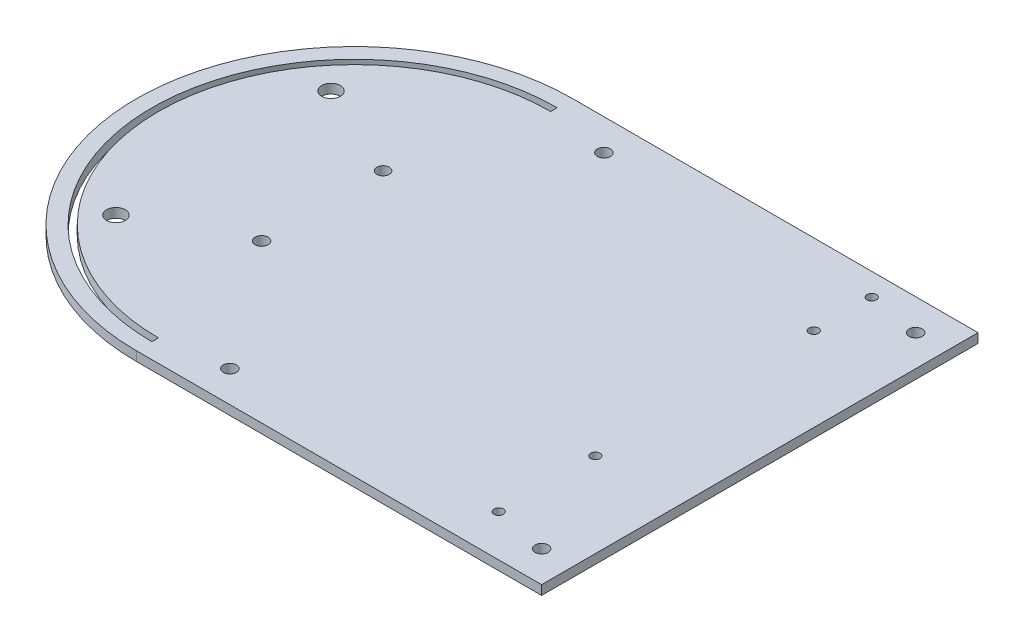
ISO-10303-21;
HEADER;
FILE_DESCRIPTION(('STEP AP214'),'2;1');
FILE_NAME('part.step','',(''),(''),'','','');
FILE_SCHEMA(('AUTOMOTIVE_DESIGN { 1 0 10303 214 1 1 1 1 }'));
ENDSEC;
DATA;
#1=APPLICATION_CONTEXT('core data for automotive mechanical design processes');
#2=APPLICATION_PROTOCOL_DEFINITION('international standard','automotive_design',2000,#1);
#3=PRODUCT_CONTEXT('',#1,'mechanical');
#4=PRODUCT('Part','Part','',(#3));
#5=PRODUCT_RELATED_PRODUCT_CATEGORY('part','',(#4));
#6=PRODUCT_DEFINITION_FORMATION('','',#4);
#7=PRODUCT_DEFINITION_CONTEXT('part definition',#1,'design');
#8=PRODUCT_DEFINITION('design','',#6,#7);
#9=PRODUCT_DEFINITION_SHAPE('','',#8);
#10=(LENGTH_UNIT() NAMED_UNIT(*) SI_UNIT(.MILLI.,.METRE.));
#11=(NAMED_UNIT(*) PLANE_ANGLE_UNIT() SI_UNIT($,.RADIAN.));
#12=(NAMED_UNIT(*) SI_UNIT($,.STERADIAN.) SOLID_ANGLE_UNIT());
#13=UNCERTAINTY_MEASURE_WITH_UNIT(LENGTH_MEASURE(1.E-05),#10,'distance_accuracy_value','');
#14=(GEOMETRIC_REPRESENTATION_CONTEXT(3) GLOBAL_UNCERTAINTY_ASSIGNED_CONTEXT((#13)) GLOBAL_UNIT_ASSIGNED_CONTEXT((#10,
#11,#12)) REPRESENTATION_CONTEXT('',''));
#15=CARTESIAN_POINT('',(0.,0.,0.));
#16=DIRECTION('',(0.,0.,1.));
#17=DIRECTION('',(1.,0.,0.));
#18=AXIS2_PLACEMENT_3D('',#15,#16,#17);
#19=CARTESIAN_POINT('',(-65.,3.,0.));
#20=DIRECTION('',(0.,-1.,0.));
#21=DIRECTION('',(0.,0.,-1.));
#22=AXIS2_PLACEMENT_3D('',#19,#20,#21);
#23=PLANE('',#22);
#24=CARTESIAN_POINT('',(-65.,3.,0.));
#25=DIRECTION('',(0.,1.,0.));
#26=DIRECTION('',(0.,0.,-1.));
#27=AXIS2_PLACEMENT_3D('',#24,#25,#26);
#28=CIRCLE('',#27,70.);
#29=CARTESIAN_POINT('',(-65.,3.,-70.));
#30=VERTEX_POINT('',#29);
#31=CARTESIAN_POINT('',(-65.,3.,70.));
#32=VERTEX_POINT('',#31);
#33=EDGE_CURVE('E141',#30,#32,#28,.T.);
#34=ORIENTED_EDGE('',*,*,#33,.T.);
#35=DIRECTION('',(1.,0.,0.));
#36=VECTOR('',#35,1.);
#37=CARTESIAN_POINT('',(65.,3.,70.));
#38=LINE('',#37,#36);
#39=CARTESIAN_POINT('',(65.,3.,70.));
#40=VERTEX_POINT('',#39);
#41=EDGE_CURVE('E144',#32,#40,#38,.T.);
#42=ORIENTED_EDGE('',*,*,#41,.T.);
#43=DIRECTION('',(0.,0.,-1.));
#44=VECTOR('',#43,1.);
#45=CARTESIAN_POINT('',(65.,3.,70.));
#46=LINE('',#45,#44);
#47=CARTESIAN_POINT('',(65.,3.,-70.));
#48=VERTEX_POINT('',#47);
#49=EDGE_CURVE('E147',#40,#48,#46,.T.);
#50=ORIENTED_EDGE('',*,*,#49,.T.);
#51=DIRECTION('',(-1.,0.,0.));
#52=VECTOR('',#51,1.);
#53=CARTESIAN_POINT('',(65.,3.,-70.));
#54=LINE('',#53,#52);
#55=EDGE_CURVE('E149',#48,#30,#54,.T.);
#56=ORIENTED_EDGE('',*,*,#55,.T.);
#57=EDGE_LOOP('',(#34,#42,#50,#56));
#58=FACE_BOUND('',#57,.T.);
#59=CARTESIAN_POINT('',(-65.,3.,0.));
#60=DIRECTION('',(0.,1.,0.));
#61=DIRECTION('',(0.,0.,-1.));
#62=AXIS2_PLACEMENT_3D('',#59,#60,#61);
#63=CIRCLE('',#62,65.);
#64=CARTESIAN_POINT('',(-65.,3.,-65.));
#65=VERTEX_POINT('',#64);
#66=CARTESIAN_POINT('',(-65.,3.,65.));
#67=VERTEX_POINT('',#66);
#68=EDGE_CURVE('E102',#65,#67,#63,.T.);
#69=ORIENTED_EDGE('',*,*,#68,.F.);
#70=DIRECTION('',(0.,0.,-1.));
#71=VECTOR('',#70,1.);
#72=CARTESIAN_POINT('',(-65.,3.,-65.));
#73=LINE('',#72,#71);
#74=CARTESIAN_POINT('',(-65.,3.,-62.9));
#75=VERTEX_POINT('',#74);
#76=EDGE_CURVE('E125',#75,#65,#73,.T.);
#77=ORIENTED_EDGE('',*,*,#76,.F.);
#78=CARTESIAN_POINT('',(-65.0000000000001,3.,0.));
#79=DIRECTION('',(0.,-1.,0.));
#80=DIRECTION('',(0.,0.,-1.));
#81=AXIS2_PLACEMENT_3D('',#78,#79,#80);
#82=CIRCLE('',#81,62.9);
#83=CARTESIAN_POINT('',(-65.,3.,62.9));
#84=VERTEX_POINT('',#83);
#85=EDGE_CURVE('E123',#84,#75,#82,.T.);
#86=ORIENTED_EDGE('',*,*,#85,.F.);
#87=DIRECTION('',(0.,0.,-1.));
#88=VECTOR('',#87,1.);
#89=CARTESIAN_POINT('',(-65.,3.,62.9));
#90=LINE('',#89,#88);
#91=EDGE_CURVE('E110',#67,#84,#90,.T.);
#92=ORIENTED_EDGE('',*,*,#91,.F.);
#93=EDGE_LOOP('',(#69,#77,#86,#92));
#94=FACE_BOUND('',#93,.T.);
#95=CARTESIAN_POINT('',(-45.,3.,60.));
#96=DIRECTION('',(0.,1.,0.));
#97=DIRECTION('',(0.,0.,1.));
#98=AXIS2_PLACEMENT_3D('',#95,#96,#97);
#99=CIRCLE('',#98,2.1);
#100=CARTESIAN_POINT('',(-45.,3.,62.1));
#101=VERTEX_POINT('',#100);
#102=EDGE_CURVE('E131',#101,#101,#99,.T.);
#103=ORIENTED_EDGE('',*,*,#102,.F.);
#104=EDGE_LOOP('',(#103));
#105=FACE_BOUND('',#104,.T.);
#106=CARTESIAN_POINT('',(-45.,3.,-60.));
#107=DIRECTION('',(0.,1.,0.));
#108=DIRECTION('',(0.,0.,1.));
#109=AXIS2_PLACEMENT_3D('',#106,#107,#108);
#110=CIRCLE('',#109,2.1);
#111=CARTESIAN_POINT('',(-45.,3.,-57.9));
#112=VERTEX_POINT('',#111);
#113=EDGE_CURVE('E333',#112,#112,#110,.T.);
#114=ORIENTED_EDGE('',*,*,#113,.F.);
#115=EDGE_LOOP('',(#114));
#116=FACE_BOUND('',#115,.T.);
#117=CARTESIAN_POINT('',(55.,3.,60.));
#118=DIRECTION('',(0.,1.,0.));
#119=DIRECTION('',(0.,0.,1.));
#120=AXIS2_PLACEMENT_3D('',#117,#118,#119);
#121=CIRCLE('',#120,2.1);
#122=CARTESIAN_POINT('',(55.,3.,62.1));
#123=VERTEX_POINT('',#122);
#124=EDGE_CURVE('E327',#123,#123,#121,.T.);
#125=ORIENTED_EDGE('',*,*,#124,.F.);
#126=EDGE_LOOP('',(#125));
#127=FACE_BOUND('',#126,.T.);
#128=CARTESIAN_POINT('',(55.,3.,-60.));
#129=DIRECTION('',(0.,1.,0.));
#130=DIRECTION('',(0.,0.,1.));
#131=AXIS2_PLACEMENT_3D('',#128,#129,#130);
#132=CIRCLE('',#131,2.1);
#133=CARTESIAN_POINT('',(55.,3.,-57.9));
#134=VERTEX_POINT('',#133);
#135=EDGE_CURVE('E321',#134,#134,#132,.T.);
#136=ORIENTED_EDGE('',*,*,#135,.F.);
#137=EDGE_LOOP('',(#136));
#138=FACE_BOUND('',#137,.T.);
#139=CARTESIAN_POINT('',(38.0992714590828,3.,-62.7999999999986));
#140=DIRECTION('',(0.,1.,0.));
#141=DIRECTION('',(0.,0.,1.));
#142=AXIS2_PLACEMENT_3D('',#139,#140,#141);
#143=CIRCLE('',#142,1.5);
#144=CARTESIAN_POINT('',(38.0992714590828,3.,-61.2999999999986));
#145=VERTEX_POINT('',#144);
#146=EDGE_CURVE('E315',#145,#145,#143,.T.);
#147=ORIENTED_EDGE('',*,*,#146,.F.);
#148=EDGE_LOOP('',(#147));
#149=FACE_BOUND('',#148,.T.);
#150=CARTESIAN_POINT('',(38.0992714590826,3.,-44.1999999999986));
#151=DIRECTION('',(0.,1.,0.));
#152=DIRECTION('',(0.,0.,1.));
#153=AXIS2_PLACEMENT_3D('',#150,#151,#152);
#154=CIRCLE('',#153,1.50000000000001);
#155=CARTESIAN_POINT('',(38.0992714590826,3.,-42.6999999999986));
#156=VERTEX_POINT('',#155);
#157=EDGE_CURVE('E309',#156,#156,#154,.T.);
#158=ORIENTED_EDGE('',*,*,#157,.F.);
#159=EDGE_LOOP('',(#158));
#160=FACE_BOUND('',#159,.T.);
#161=CARTESIAN_POINT('',(37.8419640009305,3.,25.6));
#162=DIRECTION('',(0.,1.,0.));
#163=DIRECTION('',(0.,0.,1.));
#164=AXIS2_PLACEMENT_3D('',#161,#162,#163);
#165=CIRCLE('',#164,1.50000000000054);
#166=CARTESIAN_POINT('',(37.8419640009305,3.,27.1000000000005));
#167=VERTEX_POINT('',#166);
#168=EDGE_CURVE('E303',#167,#167,#165,.T.);
#169=ORIENTED_EDGE('',*,*,#168,.F.);
#170=EDGE_LOOP('',(#169));
#171=FACE_BOUND('',#170,.T.);
#172=CARTESIAN_POINT('',(37.8419640009305,3.,56.6));
#173=DIRECTION('',(0.,1.,0.));
#174=DIRECTION('',(0.,0.,1.));
#175=AXIS2_PLACEMENT_3D('',#172,#173,#174);
#176=CIRCLE('',#175,1.50000000000052);
#177=CARTESIAN_POINT('',(37.8419640009305,3.,58.1000000000005));
#178=VERTEX_POINT('',#177);
#179=EDGE_CURVE('E297',#178,#178,#176,.T.);
#180=ORIENTED_EDGE('',*,*,#179,.F.);
#181=EDGE_LOOP('',(#180));
#182=FACE_BOUND('',#181,.T.);
#183=CARTESIAN_POINT('',(-75.400632029285,3.,19.4261499673664));
#184=DIRECTION('',(0.,1.,0.));
#185=DIRECTION('',(0.,0.,1.));
#186=AXIS2_PLACEMENT_3D('',#183,#184,#185);
#187=CIRCLE('',#186,2.1);
#188=CARTESIAN_POINT('',(-75.400632029285,3.,21.5261499673664));
#189=VERTEX_POINT('',#188);
#190=EDGE_CURVE('E291',#189,#189,#187,.T.);
#191=ORIENTED_EDGE('',*,*,#190,.F.);
#192=EDGE_LOOP('',(#191));
#193=FACE_BOUND('',#192,.T.);
#194=CARTESIAN_POINT('',(-75.3996848108392,3.,-19.5526262936676));
#195=DIRECTION('',(0.,1.,0.));
#196=DIRECTION('',(0.,0.,1.));
#197=AXIS2_PLACEMENT_3D('',#194,#195,#196);
#198=CIRCLE('',#197,2.);
#199=CARTESIAN_POINT('',(-75.3996848108392,3.,-17.5526262936676));
#200=VERTEX_POINT('',#199);
#201=EDGE_CURVE('E285',#200,#200,#198,.T.);
#202=ORIENTED_EDGE('',*,*,#201,.F.);
#203=EDGE_LOOP('',(#202));
#204=FACE_BOUND('',#203,.T.);
#205=CARTESIAN_POINT('',(-105.935731264622,3.,-33.3886238577769));
#206=DIRECTION('',(0.,1.,0.));
#207=DIRECTION('',(0.,0.,1.));
#208=AXIS2_PLACEMENT_3D('',#205,#206,#207);
#209=CIRCLE('',#208,2.99999999979191);
#210=CARTESIAN_POINT('',(-105.935731264622,3.,-30.388623857985));
#211=VERTEX_POINT('',#210);
#212=EDGE_CURVE('E279',#211,#211,#209,.T.);
#213=ORIENTED_EDGE('',*,*,#212,.F.);
#214=EDGE_LOOP('',(#213));
#215=FACE_BOUND('',#214,.T.);
#216=CARTESIAN_POINT('',(-105.935731264623,3.,35.6113761422231));
#217=DIRECTION('',(0.,1.,0.));
#218=DIRECTION('',(0.,0.,1.));
#219=AXIS2_PLACEMENT_3D('',#216,#217,#218);
#220=CIRCLE('',#219,2.99999999958095);
#221=CARTESIAN_POINT('',(-105.935731264623,3.,38.611376141804));
#222=VERTEX_POINT('',#221);
#223=EDGE_CURVE('E270',#222,#222,#220,.T.);
#224=ORIENTED_EDGE('',*,*,#223,.F.);
#225=EDGE_LOOP('',(#224));
#226=FACE_BOUND('',#225,.T.);
#227=ADVANCED_FACE('F37',(#58,#94,#105,#116,#127,#138,#149,#160,#171,#182,#193,#204,#215,#226),
#23,.F.);
#228=CARTESIAN_POINT('',(-65.,0.,0.));
#229=DIRECTION('',(0.,-1.,0.));
#230=DIRECTION('',(0.,0.,-1.));
#231=AXIS2_PLACEMENT_3D('',#228,#229,#230);
#232=PLANE('',#231);
#233=CARTESIAN_POINT('',(-105.935731264622,0.,-33.3886238577769));
#234=DIRECTION('',(0.,1.,0.));
#235=DIRECTION('',(0.,0.,1.));
#236=AXIS2_PLACEMENT_3D('',#233,#234,#235);
#237=CIRCLE('',#236,2.99999999979191);
#238=CARTESIAN_POINT('',(-105.935731264622,0.,-30.388623857985));
#239=VERTEX_POINT('',#238);
#240=EDGE_CURVE('E276',#239,#239,#237,.T.);
#241=ORIENTED_EDGE('',*,*,#240,.T.);
#242=EDGE_LOOP('',(#241));
#243=FACE_BOUND('',#242,.T.);
#244=CARTESIAN_POINT('',(-75.400632029285,0.,19.4261499673664));
#245=DIRECTION('',(0.,1.,0.));
#246=DIRECTION('',(0.,0.,1.));
#247=AXIS2_PLACEMENT_3D('',#244,#245,#246);
#248=CIRCLE('',#247,2.1);
#249=CARTESIAN_POINT('',(-75.400632029285,0.,21.5261499673664));
#250=VERTEX_POINT('',#249);
#251=EDGE_CURVE('E288',#250,#250,#248,.T.);
#252=ORIENTED_EDGE('',*,*,#251,.T.);
#253=EDGE_LOOP('',(#252));
#254=FACE_BOUND('',#253,.T.);
#255=CARTESIAN_POINT('',(37.8419640009305,0.,25.6));
#256=DIRECTION('',(0.,1.,0.));
#257=DIRECTION('',(0.,0.,1.));
#258=AXIS2_PLACEMENT_3D('',#255,#256,#257);
#259=CIRCLE('',#258,1.50000000000054);
#260=CARTESIAN_POINT('',(37.8419640009305,0.,27.1000000000005));
#261=VERTEX_POINT('',#260);
#262=EDGE_CURVE('E300',#261,#261,#259,.T.);
#263=ORIENTED_EDGE('',*,*,#262,.T.);
#264=EDGE_LOOP('',(#263));
#265=FACE_BOUND('',#264,.T.);
#266=CARTESIAN_POINT('',(38.0992714590828,0.,-62.7999999999986));
#267=DIRECTION('',(0.,1.,0.));
#268=DIRECTION('',(0.,0.,1.));
#269=AXIS2_PLACEMENT_3D('',#266,#267,#268);
#270=CIRCLE('',#269,1.5);
#271=CARTESIAN_POINT('',(38.0992714590828,0.,-61.2999999999986));
#272=VERTEX_POINT('',#271);
#273=EDGE_CURVE('E312',#272,#272,#270,.T.);
#274=ORIENTED_EDGE('',*,*,#273,.T.);
#275=EDGE_LOOP('',(#274));
#276=FACE_BOUND('',#275,.T.);
#277=CARTESIAN_POINT('',(55.,0.,60.));
#278=DIRECTION('',(0.,1.,0.));
#279=DIRECTION('',(0.,0.,1.));
#280=AXIS2_PLACEMENT_3D('',#277,#278,#279);
#281=CIRCLE('',#280,2.1);
#282=CARTESIAN_POINT('',(55.,0.,62.1));
#283=VERTEX_POINT('',#282);
#284=EDGE_CURVE('E324',#283,#283,#281,.T.);
#285=ORIENTED_EDGE('',*,*,#284,.T.);
#286=EDGE_LOOP('',(#285));
#287=FACE_BOUND('',#286,.T.);
#288=CARTESIAN_POINT('',(-45.,0.,60.));
#289=DIRECTION('',(0.,1.,0.));
#290=DIRECTION('',(0.,0.,1.));
#291=AXIS2_PLACEMENT_3D('',#288,#289,#290);
#292=CIRCLE('',#291,2.1);
#293=CARTESIAN_POINT('',(-45.,0.,62.1));
#294=VERTEX_POINT('',#293);
#295=EDGE_CURVE('E336',#294,#294,#292,.T.);
#296=ORIENTED_EDGE('',*,*,#295,.T.);
#297=EDGE_LOOP('',(#296));
#298=FACE_BOUND('',#297,.T.);
#299=CARTESIAN_POINT('',(-65.,0.,0.));
#300=DIRECTION('',(0.,1.,0.));
#301=DIRECTION('',(0.,0.,-1.));
#302=AXIS2_PLACEMENT_3D('',#299,#300,#301);
#303=CIRCLE('',#302,70.);
#304=CARTESIAN_POINT('',(-65.,0.,-70.));
#305=VERTEX_POINT('',#304);
#306=CARTESIAN_POINT('',(-65.,0.,70.));
#307=VERTEX_POINT('',#306);
#308=EDGE_CURVE('E118',#305,#307,#303,.T.);
#309=ORIENTED_EDGE('',*,*,#308,.F.);
#310=DIRECTION('',(-1.,0.,0.));
#311=VECTOR('',#310,1.);
#312=CARTESIAN_POINT('',(65.,0.,-70.));
#313=LINE('',#312,#311);
#314=CARTESIAN_POINT('',(65.,0.,-70.));
#315=VERTEX_POINT('',#314);
#316=EDGE_CURVE('E145',#315,#305,#313,.T.);
#317=ORIENTED_EDGE('',*,*,#316,.F.);
#318=DIRECTION('',(0.,0.,-1.));
#319=VECTOR('',#318,1.);
#320=CARTESIAN_POINT('',(65.,0.,70.));
#321=LINE('',#320,#319);
#322=CARTESIAN_POINT('',(65.,0.,70.));
#323=VERTEX_POINT('',#322);
#324=EDGE_CURVE('E156',#323,#315,#321,.T.);
#325=ORIENTED_EDGE('',*,*,#324,.F.);
#326=DIRECTION('',(1.,0.,0.));
#327=VECTOR('',#326,1.);
#328=CARTESIAN_POINT('',(65.,0.,70.));
#329=LINE('',#328,#327);
#330=EDGE_CURVE('E154',#307,#323,#329,.T.);
#331=ORIENTED_EDGE('',*,*,#330,.F.);
#332=EDGE_LOOP('',(#309,#317,#325,#331));
#333=FACE_BOUND('',#332,.T.);
#334=DIRECTION('',(0.,0.,-1.));
#335=VECTOR('',#334,1.);
#336=CARTESIAN_POINT('',(-65.,0.,-65.));
#337=LINE('',#336,#335);
#338=CARTESIAN_POINT('',(-65.0000000000001,0.,-62.9));
#339=VERTEX_POINT('',#338);
#340=CARTESIAN_POINT('',(-65.,0.,-65.));
#341=VERTEX_POINT('',#340);
#342=EDGE_CURVE('E111',#339,#341,#337,.T.);
#343=ORIENTED_EDGE('',*,*,#342,.T.);
#344=CARTESIAN_POINT('',(-65.,0.,0.));
#345=DIRECTION('',(0.,1.,0.));
#346=DIRECTION('',(0.,0.,-1.));
#347=AXIS2_PLACEMENT_3D('',#344,#345,#346);
#348=CIRCLE('',#347,65.);
#349=CARTESIAN_POINT('',(-65.,0.,65.));
#350=VERTEX_POINT('',#349);
#351=EDGE_CURVE('E60',#341,#350,#348,.T.);
#352=ORIENTED_EDGE('',*,*,#351,.T.);
#353=DIRECTION('',(0.,0.,-1.));
#354=VECTOR('',#353,1.);
#355=CARTESIAN_POINT('',(-65.,0.,62.9));
#356=LINE('',#355,#354);
#357=CARTESIAN_POINT('',(-65.,0.,62.9));
#358=VERTEX_POINT('',#357);
#359=EDGE_CURVE('E117',#350,#358,#356,.T.);
#360=ORIENTED_EDGE('',*,*,#359,.T.);
#361=CARTESIAN_POINT('',(-65.0000000000001,0.,0.));
#362=DIRECTION('',(0.,-1.,0.));
#363=DIRECTION('',(0.,0.,-1.));
#364=AXIS2_PLACEMENT_3D('',#361,#362,#363);
#365=CIRCLE('',#364,62.9);
#366=EDGE_CURVE('E133',#358,#339,#365,.T.);
#367=ORIENTED_EDGE('',*,*,#366,.T.);
#368=EDGE_LOOP('',(#343,#352,#360,#367));
#369=FACE_BOUND('',#368,.T.);
#370=CARTESIAN_POINT('',(-45.,0.,-60.));
#371=DIRECTION('',(0.,1.,0.));
#372=DIRECTION('',(0.,0.,1.));
#373=AXIS2_PLACEMENT_3D('',#370,#371,#372);
#374=CIRCLE('',#373,2.1);
#375=CARTESIAN_POINT('',(-45.,0.,-57.9));
#376=VERTEX_POINT('',#375);
#377=EDGE_CURVE('E330',#376,#376,#374,.T.);
#378=ORIENTED_EDGE('',*,*,#377,.T.);
#379=EDGE_LOOP('',(#378));
#380=FACE_BOUND('',#379,.T.);
#381=CARTESIAN_POINT('',(55.,0.,-60.));
#382=DIRECTION('',(0.,1.,0.));
#383=DIRECTION('',(0.,0.,1.));
#384=AXIS2_PLACEMENT_3D('',#381,#382,#383);
#385=CIRCLE('',#384,2.1);
#386=CARTESIAN_POINT('',(55.,0.,-57.9));
#387=VERTEX_POINT('',#386);
#388=EDGE_CURVE('E318',#387,#387,#385,.T.);
#389=ORIENTED_EDGE('',*,*,#388,.T.);
#390=EDGE_LOOP('',(#389));
#391=FACE_BOUND('',#390,.T.);
#392=CARTESIAN_POINT('',(38.0992714590826,0.,-44.1999999999986));
#393=DIRECTION('',(0.,1.,0.));
#394=DIRECTION('',(0.,0.,1.));
#395=AXIS2_PLACEMENT_3D('',#392,#393,#394);
#396=CIRCLE('',#395,1.50000000000001);
#397=CARTESIAN_POINT('',(38.0992714590826,0.,-42.6999999999986));
#398=VERTEX_POINT('',#397);
#399=EDGE_CURVE('E306',#398,#398,#396,.T.);
#400=ORIENTED_EDGE('',*,*,#399,.T.);
#401=EDGE_LOOP('',(#400));
#402=FACE_BOUND('',#401,.T.);
#403=CARTESIAN_POINT('',(37.8419640009305,0.,56.6));
#404=DIRECTION('',(0.,1.,0.));
#405=DIRECTION('',(0.,0.,1.));
#406=AXIS2_PLACEMENT_3D('',#403,#404,#405);
#407=CIRCLE('',#406,1.50000000000052);
#408=CARTESIAN_POINT('',(37.8419640009305,0.,58.1000000000005));
#409=VERTEX_POINT('',#408);
#410=EDGE_CURVE('E294',#409,#409,#407,.T.);
#411=ORIENTED_EDGE('',*,*,#410,.T.);
#412=EDGE_LOOP('',(#411));
#413=FACE_BOUND('',#412,.T.);
#414=CARTESIAN_POINT('',(-75.3996848108392,0.,-19.5526262936676));
#415=DIRECTION('',(0.,1.,0.));
#416=DIRECTION('',(0.,0.,1.));
#417=AXIS2_PLACEMENT_3D('',#414,#415,#416);
#418=CIRCLE('',#417,2.);
#419=CARTESIAN_POINT('',(-75.3996848108392,0.,-17.5526262936676));
#420=VERTEX_POINT('',#419);
#421=EDGE_CURVE('E282',#420,#420,#418,.T.);
#422=ORIENTED_EDGE('',*,*,#421,.T.);
#423=EDGE_LOOP('',(#422));
#424=FACE_BOUND('',#423,.T.);
#425=CARTESIAN_POINT('',(-105.935731264623,0.,35.6113761422231));
#426=DIRECTION('',(0.,1.,0.));
#427=DIRECTION('',(0.,0.,1.));
#428=AXIS2_PLACEMENT_3D('',#425,#426,#427);
#429=CIRCLE('',#428,2.99999999958095);
#430=CARTESIAN_POINT('',(-105.935731264623,0.,38.611376141804));
#431=VERTEX_POINT('',#430);
#432=EDGE_CURVE('E273',#431,#431,#429,.T.);
#433=ORIENTED_EDGE('',*,*,#432,.T.);
#434=EDGE_LOOP('',(#433));
#435=FACE_BOUND('',#434,.T.);
#436=ADVANCED_FACE('F174',(#243,#254,#265,#276,#287,#298,#333,#369,#380,#391,#402,#413,#424,
#435),#232,.T.);
#437=CARTESIAN_POINT('',(-65.,3.,0.));
#438=DIRECTION('',(0.,-1.,0.));
#439=DIRECTION('',(0.,0.,-1.));
#440=AXIS2_PLACEMENT_3D('',#437,#438,#439);
#441=CYLINDRICAL_SURFACE('',#440,70.);
#442=ORIENTED_EDGE('',*,*,#308,.T.);
#443=DIRECTION('',(0.,-1.,0.));
#444=VECTOR('',#443,1.);
#445=CARTESIAN_POINT('',(-65.,3.,70.));
#446=LINE('',#445,#444);
#447=EDGE_CURVE('E11',#32,#307,#446,.T.);
#448=ORIENTED_EDGE('',*,*,#447,.F.);
#449=ORIENTED_EDGE('',*,*,#33,.F.);
#450=DIRECTION('',(0.,-1.,0.));
#451=VECTOR('',#450,1.);
#452=CARTESIAN_POINT('',(-65.,3.,-70.));
#453=LINE('',#452,#451);
#454=EDGE_CURVE('E151',#30,#305,#453,.T.);
#455=ORIENTED_EDGE('',*,*,#454,.T.);
#456=EDGE_LOOP('',(#442,#448,#449,#455));
#457=FACE_BOUND('',#456,.T.);
#458=ADVANCED_FACE('F39',(#457),#441,.T.);
#459=CARTESIAN_POINT('',(65.,3.,70.));
#460=DIRECTION('',(0.,0.,-1.));
#461=DIRECTION('',(-1.,0.,0.));
#462=AXIS2_PLACEMENT_3D('',#459,#460,#461);
#463=PLANE('',#462);
#464=ORIENTED_EDGE('',*,*,#330,.T.);
#465=DIRECTION('',(0.,-1.,0.));
#466=VECTOR('',#465,1.);
#467=CARTESIAN_POINT('',(65.,3.,70.));
#468=LINE('',#467,#466);
#469=EDGE_CURVE('E45',#40,#323,#468,.T.);
#470=ORIENTED_EDGE('',*,*,#469,.F.);
#471=ORIENTED_EDGE('',*,*,#41,.F.);
#472=ORIENTED_EDGE('',*,*,#447,.T.);
#473=EDGE_LOOP('',(#464,#470,#471,#472));
#474=FACE_BOUND('',#473,.T.);
#475=ADVANCED_FACE('F184',(#474),#463,.F.);
#476=CARTESIAN_POINT('',(65.,3.,70.));
#477=DIRECTION('',(-1.,0.,0.));
#478=DIRECTION('',(0.,0.,1.));
#479=AXIS2_PLACEMENT_3D('',#476,#477,#478);
#480=PLANE('',#479);
#481=ORIENTED_EDGE('',*,*,#324,.T.);
#482=DIRECTION('',(0.,-1.,0.));
#483=VECTOR('',#482,1.);
#484=CARTESIAN_POINT('',(65.,3.,-70.));
#485=LINE('',#484,#483);
#486=EDGE_CURVE('E161',#48,#315,#485,.T.);
#487=ORIENTED_EDGE('',*,*,#486,.F.);
#488=ORIENTED_EDGE('',*,*,#49,.F.);
#489=ORIENTED_EDGE('',*,*,#469,.T.);
#490=EDGE_LOOP('',(#481,#487,#488,#489));
#491=FACE_BOUND('',#490,.T.);
#492=ADVANCED_FACE('F168',(#491),#480,.F.);
#493=CARTESIAN_POINT('',(65.,3.,-70.));
#494=DIRECTION('',(0.,0.,1.));
#495=DIRECTION('',(1.,0.,0.));
#496=AXIS2_PLACEMENT_3D('',#493,#494,#495);
#497=PLANE('',#496);
#498=ORIENTED_EDGE('',*,*,#316,.T.);
#499=ORIENTED_EDGE('',*,*,#454,.F.);
#500=ORIENTED_EDGE('',*,*,#55,.F.);
#501=ORIENTED_EDGE('',*,*,#486,.T.);
#502=EDGE_LOOP('',(#498,#499,#500,#501));
#503=FACE_BOUND('',#502,.T.);
#504=ADVANCED_FACE('F178',(#503),#497,.F.);
#505=CARTESIAN_POINT('',(-65.,3.,0.));
#506=DIRECTION('',(0.,-1.,0.));
#507=DIRECTION('',(0.,0.,-1.));
#508=AXIS2_PLACEMENT_3D('',#505,#506,#507);
#509=CYLINDRICAL_SURFACE('',#508,65.);
#510=ORIENTED_EDGE('',*,*,#351,.F.);
#511=DIRECTION('',(0.,-1.,0.));
#512=VECTOR('',#511,1.);
#513=CARTESIAN_POINT('',(-65.,3.,-65.));
#514=LINE('',#513,#512);
#515=EDGE_CURVE('E106',#65,#341,#514,.T.);
#516=ORIENTED_EDGE('',*,*,#515,.F.);
#517=ORIENTED_EDGE('',*,*,#68,.T.);
#518=DIRECTION('',(0.,-1.,0.));
#519=VECTOR('',#518,1.);
#520=CARTESIAN_POINT('',(-65.,3.,65.));
#521=LINE('',#520,#519);
#522=EDGE_CURVE('E105',#67,#350,#521,.T.);
#523=ORIENTED_EDGE('',*,*,#522,.T.);
#524=EDGE_LOOP('',(#510,#516,#517,#523));
#525=FACE_BOUND('',#524,.T.);
#526=ADVANCED_FACE('F104',(#525),#509,.F.);
#527=CARTESIAN_POINT('',(-65.,3.,62.9));
#528=DIRECTION('',(-1.,0.,0.));
#529=DIRECTION('',(0.,0.,1.));
#530=AXIS2_PLACEMENT_3D('',#527,#528,#529);
#531=PLANE('',#530);
#532=ORIENTED_EDGE('',*,*,#359,.F.);
#533=ORIENTED_EDGE('',*,*,#522,.F.);
#534=ORIENTED_EDGE('',*,*,#91,.T.);
#535=DIRECTION('',(0.,-1.,0.));
#536=VECTOR('',#535,1.);
#537=CARTESIAN_POINT('',(-65.,3.,62.9));
#538=LINE('',#537,#536);
#539=EDGE_CURVE('E119',#84,#358,#538,.T.);
#540=ORIENTED_EDGE('',*,*,#539,.T.);
#541=EDGE_LOOP('',(#532,#533,#534,#540));
#542=FACE_BOUND('',#541,.T.);
#543=ADVANCED_FACE('F114',(#542),#531,.T.);
#544=CARTESIAN_POINT('',(-65.0000000000001,3.,0.));
#545=DIRECTION('',(0.,-1.,0.));
#546=DIRECTION('',(0.,0.,-1.));
#547=AXIS2_PLACEMENT_3D('',#544,#545,#546);
#548=CYLINDRICAL_SURFACE('',#547,62.9);
#549=ORIENTED_EDGE('',*,*,#366,.F.);
#550=ORIENTED_EDGE('',*,*,#539,.F.);
#551=ORIENTED_EDGE('',*,*,#85,.T.);
#552=DIRECTION('',(0.,-1.,0.));
#553=VECTOR('',#552,1.);
#554=CARTESIAN_POINT('',(-65.0000000000001,3.,-62.9));
#555=LINE('',#554,#553);
#556=EDGE_CURVE('E52',#75,#339,#555,.T.);
#557=ORIENTED_EDGE('',*,*,#556,.T.);
#558=EDGE_LOOP('',(#549,#550,#551,#557));
#559=FACE_BOUND('',#558,.T.);
#560=ADVANCED_FACE('F208',(#559),#548,.T.);
#561=CARTESIAN_POINT('',(-65.,3.,-65.));
#562=DIRECTION('',(-1.,0.,0.));
#563=DIRECTION('',(0.,0.,1.));
#564=AXIS2_PLACEMENT_3D('',#561,#562,#563);
#565=PLANE('',#564);
#566=ORIENTED_EDGE('',*,*,#342,.F.);
#567=ORIENTED_EDGE('',*,*,#556,.F.);
#568=ORIENTED_EDGE('',*,*,#76,.T.);
#569=ORIENTED_EDGE('',*,*,#515,.T.);
#570=EDGE_LOOP('',(#566,#567,#568,#569));
#571=FACE_BOUND('',#570,.T.);
#572=ADVANCED_FACE('F212',(#571),#565,.T.);
#573=CARTESIAN_POINT('',(-45.,3.,60.));
#574=DIRECTION('',(0.,-1.,0.));
#575=DIRECTION('',(0.,0.,-1.));
#576=AXIS2_PLACEMENT_3D('',#573,#574,#575);
#577=CYLINDRICAL_SURFACE('',#576,2.1);
#578=ORIENTED_EDGE('',*,*,#102,.T.);
#579=EDGE_LOOP('',(#578));
#580=FACE_BOUND('',#579,.T.);
#581=ORIENTED_EDGE('',*,*,#295,.F.);
#582=EDGE_LOOP('',(#581));
#583=FACE_BOUND('',#582,.T.);
#584=ADVANCED_FACE('F218',(#580,#583),#577,.F.);
#585=CARTESIAN_POINT('',(-45.,3.,-60.));
#586=DIRECTION('',(0.,-1.,0.));
#587=DIRECTION('',(0.,0.,-1.));
#588=AXIS2_PLACEMENT_3D('',#585,#586,#587);
#589=CYLINDRICAL_SURFACE('',#588,2.1);
#590=ORIENTED_EDGE('',*,*,#113,.T.);
#591=EDGE_LOOP('',(#590));
#592=FACE_BOUND('',#591,.T.);
#593=ORIENTED_EDGE('',*,*,#377,.F.);
#594=EDGE_LOOP('',(#593));
#595=FACE_BOUND('',#594,.T.);
#596=ADVANCED_FACE('F221',(#592,#595),#589,.F.);
#597=CARTESIAN_POINT('',(55.,3.,60.));
#598=DIRECTION('',(0.,-1.,0.));
#599=DIRECTION('',(0.,0.,-1.));
#600=AXIS2_PLACEMENT_3D('',#597,#598,#599);
#601=CYLINDRICAL_SURFACE('',#600,2.1);
#602=ORIENTED_EDGE('',*,*,#124,.T.);
#603=EDGE_LOOP('',(#602));
#604=FACE_BOUND('',#603,.T.);
#605=ORIENTED_EDGE('',*,*,#284,.F.);
#606=EDGE_LOOP('',(#605));
#607=FACE_BOUND('',#606,.T.);
#608=ADVANCED_FACE('F225',(#604,#607),#601,.F.);
#609=CARTESIAN_POINT('',(55.,3.,-60.));
#610=DIRECTION('',(0.,-1.,0.));
#611=DIRECTION('',(0.,0.,-1.));
#612=AXIS2_PLACEMENT_3D('',#609,#610,#611);
#613=CYLINDRICAL_SURFACE('',#612,2.1);
#614=ORIENTED_EDGE('',*,*,#135,.T.);
#615=EDGE_LOOP('',(#614));
#616=FACE_BOUND('',#615,.T.);
#617=ORIENTED_EDGE('',*,*,#388,.F.);
#618=EDGE_LOOP('',(#617));
#619=FACE_BOUND('',#618,.T.);
#620=ADVANCED_FACE('F229',(#616,#619),#613,.F.);
#621=CARTESIAN_POINT('',(38.0992714590828,3.,-62.7999999999986));
#622=DIRECTION('',(0.,-1.,0.));
#623=DIRECTION('',(0.,0.,-1.));
#624=AXIS2_PLACEMENT_3D('',#621,#622,#623);
#625=CYLINDRICAL_SURFACE('',#624,1.5);
#626=ORIENTED_EDGE('',*,*,#146,.T.);
#627=EDGE_LOOP('',(#626));
#628=FACE_BOUND('',#627,.T.);
#629=ORIENTED_EDGE('',*,*,#273,.F.);
#630=EDGE_LOOP('',(#629));
#631=FACE_BOUND('',#630,.T.);
#632=ADVANCED_FACE('F233',(#628,#631),#625,.F.);
#633=CARTESIAN_POINT('',(38.0992714590826,3.,-44.1999999999986));
#634=DIRECTION('',(0.,-1.,0.));
#635=DIRECTION('',(0.,0.,-1.));
#636=AXIS2_PLACEMENT_3D('',#633,#634,#635);
#637=CYLINDRICAL_SURFACE('',#636,1.50000000000001);
#638=ORIENTED_EDGE('',*,*,#157,.T.);
#639=EDGE_LOOP('',(#638));
#640=FACE_BOUND('',#639,.T.);
#641=ORIENTED_EDGE('',*,*,#399,.F.);
#642=EDGE_LOOP('',(#641));
#643=FACE_BOUND('',#642,.T.);
#644=ADVANCED_FACE('F237',(#640,#643),#637,.F.);
#645=CARTESIAN_POINT('',(37.8419640009305,3.,25.6));
#646=DIRECTION('',(0.,-1.,0.));
#647=DIRECTION('',(0.,0.,-1.));
#648=AXIS2_PLACEMENT_3D('',#645,#646,#647);
#649=CYLINDRICAL_SURFACE('',#648,1.50000000000054);
#650=ORIENTED_EDGE('',*,*,#168,.T.);
#651=EDGE_LOOP('',(#650));
#652=FACE_BOUND('',#651,.T.);
#653=ORIENTED_EDGE('',*,*,#262,.F.);
#654=EDGE_LOOP('',(#653));
#655=FACE_BOUND('',#654,.T.);
#656=ADVANCED_FACE('F241',(#652,#655),#649,.F.);
#657=CARTESIAN_POINT('',(37.8419640009305,3.,56.6));
#658=DIRECTION('',(0.,-1.,0.));
#659=DIRECTION('',(0.,0.,-1.));
#660=AXIS2_PLACEMENT_3D('',#657,#658,#659);
#661=CYLINDRICAL_SURFACE('',#660,1.50000000000052);
#662=ORIENTED_EDGE('',*,*,#179,.T.);
#663=EDGE_LOOP('',(#662));
#664=FACE_BOUND('',#663,.T.);
#665=ORIENTED_EDGE('',*,*,#410,.F.);
#666=EDGE_LOOP('',(#665));
#667=FACE_BOUND('',#666,.T.);
#668=ADVANCED_FACE('F245',(#664,#667),#661,.F.);
#669=CARTESIAN_POINT('',(-75.400632029285,3.,19.4261499673664));
#670=DIRECTION('',(0.,-1.,0.));
#671=DIRECTION('',(0.,0.,-1.));
#672=AXIS2_PLACEMENT_3D('',#669,#670,#671);
#673=CYLINDRICAL_SURFACE('',#672,2.1);
#674=ORIENTED_EDGE('',*,*,#190,.T.);
#675=EDGE_LOOP('',(#674));
#676=FACE_BOUND('',#675,.T.);
#677=ORIENTED_EDGE('',*,*,#251,.F.);
#678=EDGE_LOOP('',(#677));
#679=FACE_BOUND('',#678,.T.);
#680=ADVANCED_FACE('F249',(#676,#679),#673,.F.);
#681=CARTESIAN_POINT('',(-75.3996848108392,3.,-19.5526262936676));
#682=DIRECTION('',(0.,-1.,0.));
#683=DIRECTION('',(0.,0.,-1.));
#684=AXIS2_PLACEMENT_3D('',#681,#682,#683);
#685=CYLINDRICAL_SURFACE('',#684,2.);
#686=ORIENTED_EDGE('',*,*,#201,.T.);
#687=EDGE_LOOP('',(#686));
#688=FACE_BOUND('',#687,.T.);
#689=ORIENTED_EDGE('',*,*,#421,.F.);
#690=EDGE_LOOP('',(#689));
#691=FACE_BOUND('',#690,.T.);
#692=ADVANCED_FACE('F253',(#688,#691),#685,.F.);
#693=CARTESIAN_POINT('',(-105.935731264622,3.,-33.3886238577769));
#694=DIRECTION('',(0.,-1.,0.));
#695=DIRECTION('',(0.,0.,-1.));
#696=AXIS2_PLACEMENT_3D('',#693,#694,#695);
#697=CYLINDRICAL_SURFACE('',#696,2.99999999979191);
#698=ORIENTED_EDGE('',*,*,#212,.T.);
#699=EDGE_LOOP('',(#698));
#700=FACE_BOUND('',#699,.T.);
#701=ORIENTED_EDGE('',*,*,#240,.F.);
#702=EDGE_LOOP('',(#701));
#703=FACE_BOUND('',#702,.T.);
#704=ADVANCED_FACE('F257',(#700,#703),#697,.F.);
#705=CARTESIAN_POINT('',(-105.935731264623,3.,35.6113761422231));
#706=DIRECTION('',(0.,-1.,0.));
#707=DIRECTION('',(0.,0.,-1.));
#708=AXIS2_PLACEMENT_3D('',#705,#706,#707);
#709=CYLINDRICAL_SURFACE('',#708,2.99999999958095);
#710=ORIENTED_EDGE('',*,*,#223,.T.);
#711=EDGE_LOOP('',(#710));
#712=FACE_BOUND('',#711,.T.);
#713=ORIENTED_EDGE('',*,*,#432,.F.);
#714=EDGE_LOOP('',(#713));
#715=FACE_BOUND('',#714,.T.);
#716=ADVANCED_FACE('F261',(#712,#715),#709,.F.);
#717=CLOSED_SHELL('',(#227,#436,#458,#475,#492,#504,#526,#543,#560,#572,#584,#596,#608,#620,
#632,#644,#656,#668,#680,#692,#704,#716));
#718=MANIFOLD_SOLID_BREP('B2',#717);
#719=ADVANCED_BREP_SHAPE_REPRESENTATION('',(#18,#718),#14);
#720=SHAPE_DEFINITION_REPRESENTATION(#9,#719);
ENDSEC;
END-ISO-10303-21;
